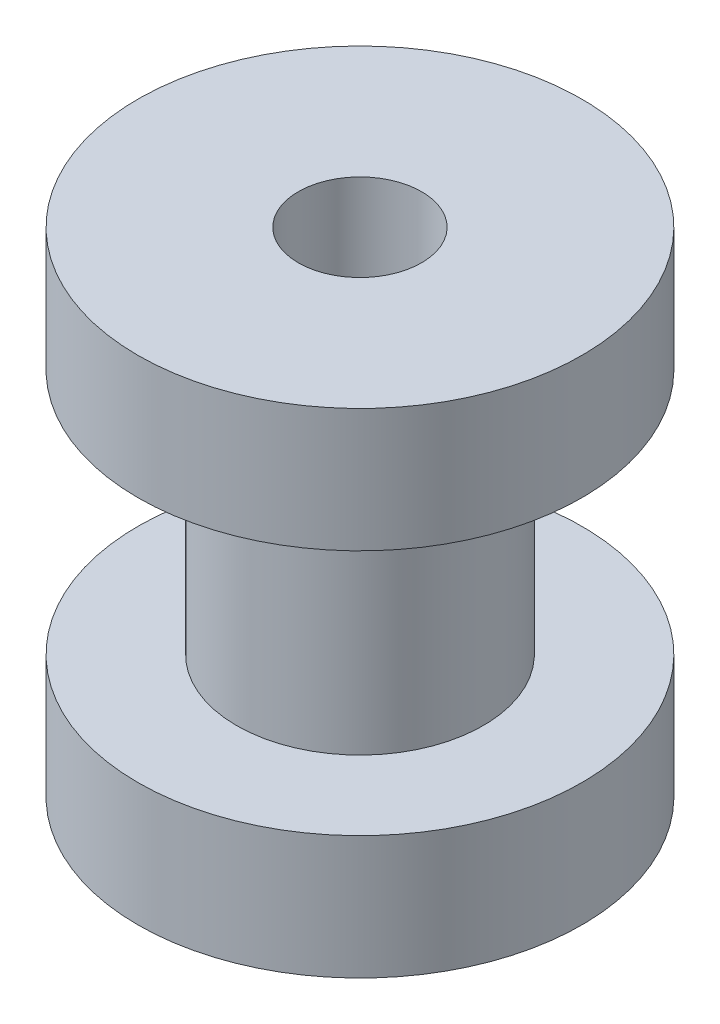
ISO-10303-21;
HEADER;
FILE_DESCRIPTION(('STEP AP214'),'2;1');
FILE_NAME('part.step','',(''),(''),'','','');
FILE_SCHEMA(('AUTOMOTIVE_DESIGN { 1 0 10303 214 1 1 1 1 }'));
ENDSEC;
DATA;
#1=APPLICATION_CONTEXT('core data for automotive mechanical design processes');
#2=APPLICATION_PROTOCOL_DEFINITION('international standard','automotive_design',2000,#1);
#3=PRODUCT_CONTEXT('',#1,'mechanical');
#4=PRODUCT('Part','Part','',(#3));
#5=PRODUCT_RELATED_PRODUCT_CATEGORY('part','',(#4));
#6=PRODUCT_DEFINITION_FORMATION('','',#4);
#7=PRODUCT_DEFINITION_CONTEXT('part definition',#1,'design');
#8=PRODUCT_DEFINITION('design','',#6,#7);
#9=PRODUCT_DEFINITION_SHAPE('','',#8);
#10=(LENGTH_UNIT() NAMED_UNIT(*) SI_UNIT(.MILLI.,.METRE.));
#11=(NAMED_UNIT(*) PLANE_ANGLE_UNIT() SI_UNIT($,.RADIAN.));
#12=(NAMED_UNIT(*) SI_UNIT($,.STERADIAN.) SOLID_ANGLE_UNIT());
#13=UNCERTAINTY_MEASURE_WITH_UNIT(LENGTH_MEASURE(1.E-05),#10,'distance_accuracy_value','');
#14=(GEOMETRIC_REPRESENTATION_CONTEXT(3) GLOBAL_UNCERTAINTY_ASSIGNED_CONTEXT((#13)) GLOBAL_UNIT_ASSIGNED_CONTEXT((#10,
#11,#12)) REPRESENTATION_CONTEXT('',''));
#15=CARTESIAN_POINT('',(0.,0.,0.));
#16=DIRECTION('',(0.,0.,1.));
#17=DIRECTION('',(1.,0.,0.));
#18=AXIS2_PLACEMENT_3D('',#15,#16,#17);
#19=CARTESIAN_POINT('',(0.,5.,0.));
#20=DIRECTION('',(0.,-1.,0.));
#21=DIRECTION('',(0.,0.,-1.));
#22=AXIS2_PLACEMENT_3D('',#19,#20,#21);
#23=CYLINDRICAL_SURFACE('',#22,5.);
#24=CARTESIAN_POINT('',(0.,5.,0.));
#25=DIRECTION('',(0.,1.,0.));
#26=DIRECTION('',(0.,0.,1.));
#27=AXIS2_PLACEMENT_3D('',#24,#25,#26);
#28=CIRCLE('',#27,5.);
#29=CARTESIAN_POINT('',(0.,5.,5.));
#30=VERTEX_POINT('',#29);
#31=EDGE_CURVE('E10',#30,#30,#28,.T.);
#32=ORIENTED_EDGE('',*,*,#31,.F.);
#33=EDGE_LOOP('',(#32));
#34=FACE_BOUND('',#33,.T.);
#35=CARTESIAN_POINT('',(0.,-5.,0.));
#36=DIRECTION('',(0.,1.,0.));
#37=DIRECTION('',(0.,0.,1.));
#38=AXIS2_PLACEMENT_3D('',#35,#36,#37);
#39=CIRCLE('',#38,5.);
#40=CARTESIAN_POINT('',(0.,-5.,5.));
#41=VERTEX_POINT('',#40);
#42=EDGE_CURVE('E54',#41,#41,#39,.T.);
#43=ORIENTED_EDGE('',*,*,#42,.T.);
#44=EDGE_LOOP('',(#43));
#45=FACE_BOUND('',#44,.T.);
#46=ADVANCED_FACE('F39',(#34,#45),#23,.T.);
#47=CARTESIAN_POINT('',(0.,10.,0.));
#48=DIRECTION('',(0.,-1.,0.));
#49=DIRECTION('',(0.,0.,-1.));
#50=AXIS2_PLACEMENT_3D('',#47,#48,#49);
#51=CYLINDRICAL_SURFACE('',#50,9.);
#52=CARTESIAN_POINT('',(0.,10.,0.));
#53=DIRECTION('',(0.,1.,0.));
#54=DIRECTION('',(0.,0.,1.));
#55=AXIS2_PLACEMENT_3D('',#52,#53,#54);
#56=CIRCLE('',#55,9.);
#57=CARTESIAN_POINT('',(0.,10.,9.));
#58=VERTEX_POINT('',#57);
#59=EDGE_CURVE('E45',#58,#58,#56,.T.);
#60=ORIENTED_EDGE('',*,*,#59,.F.);
#61=EDGE_LOOP('',(#60));
#62=FACE_BOUND('',#61,.T.);
#63=CARTESIAN_POINT('',(0.,5.,0.));
#64=DIRECTION('',(0.,1.,0.));
#65=DIRECTION('',(0.,0.,1.));
#66=AXIS2_PLACEMENT_3D('',#63,#64,#65);
#67=CIRCLE('',#66,9.);
#68=CARTESIAN_POINT('',(0.,5.,9.));
#69=VERTEX_POINT('',#68);
#70=EDGE_CURVE('E49',#69,#69,#67,.T.);
#71=ORIENTED_EDGE('',*,*,#70,.T.);
#72=EDGE_LOOP('',(#71));
#73=FACE_BOUND('',#72,.T.);
#74=ADVANCED_FACE('F76',(#62,#73),#51,.T.);
#75=CARTESIAN_POINT('',(0.,10.,0.));
#76=DIRECTION('',(0.,1.,0.));
#77=DIRECTION('',(0.,0.,1.));
#78=AXIS2_PLACEMENT_3D('',#75,#76,#77);
#79=PLANE('',#78);
#80=CARTESIAN_POINT('',(0.,10.,0.));
#81=DIRECTION('',(0.,1.,0.));
#82=DIRECTION('',(0.,0.,1.));
#83=AXIS2_PLACEMENT_3D('',#80,#81,#82);
#84=CIRCLE('',#83,2.5);
#85=CARTESIAN_POINT('',(0.,10.,2.5));
#86=VERTEX_POINT('',#85);
#87=EDGE_CURVE('E67',#86,#86,#84,.T.);
#88=ORIENTED_EDGE('',*,*,#87,.F.);
#89=EDGE_LOOP('',(#88));
#90=FACE_BOUND('',#89,.T.);
#91=ORIENTED_EDGE('',*,*,#59,.T.);
#92=EDGE_LOOP('',(#91));
#93=FACE_BOUND('',#92,.T.);
#94=ADVANCED_FACE('F73',(#90,#93),#79,.T.);
#95=CARTESIAN_POINT('',(0.,5.,0.));
#96=DIRECTION('',(0.,1.,0.));
#97=DIRECTION('',(0.,0.,1.));
#98=AXIS2_PLACEMENT_3D('',#95,#96,#97);
#99=PLANE('',#98);
#100=ORIENTED_EDGE('',*,*,#31,.T.);
#101=EDGE_LOOP('',(#100));
#102=FACE_BOUND('',#101,.T.);
#103=ORIENTED_EDGE('',*,*,#70,.F.);
#104=EDGE_LOOP('',(#103));
#105=FACE_BOUND('',#104,.T.);
#106=ADVANCED_FACE('F75',(#102,#105),#99,.F.);
#107=CARTESIAN_POINT('',(0.,-10.,0.));
#108=DIRECTION('',(0.,1.,0.));
#109=DIRECTION('',(0.,0.,1.));
#110=AXIS2_PLACEMENT_3D('',#107,#108,#109);
#111=CYLINDRICAL_SURFACE('',#110,9.);
#112=CARTESIAN_POINT('',(0.,-10.,0.));
#113=DIRECTION('',(0.,1.,0.));
#114=DIRECTION('',(0.,0.,1.));
#115=AXIS2_PLACEMENT_3D('',#112,#113,#114);
#116=CIRCLE('',#115,9.);
#117=CARTESIAN_POINT('',(0.,-10.,9.));
#118=VERTEX_POINT('',#117);
#119=EDGE_CURVE('E58',#118,#118,#116,.T.);
#120=ORIENTED_EDGE('',*,*,#119,.T.);
#121=EDGE_LOOP('',(#120));
#122=FACE_BOUND('',#121,.T.);
#123=CARTESIAN_POINT('',(0.,-5.,0.));
#124=DIRECTION('',(0.,1.,0.));
#125=DIRECTION('',(0.,0.,1.));
#126=AXIS2_PLACEMENT_3D('',#123,#124,#125);
#127=CIRCLE('',#126,9.);
#128=CARTESIAN_POINT('',(0.,-5.,9.));
#129=VERTEX_POINT('',#128);
#130=EDGE_CURVE('E59',#129,#129,#127,.T.);
#131=ORIENTED_EDGE('',*,*,#130,.F.);
#132=EDGE_LOOP('',(#131));
#133=FACE_BOUND('',#132,.T.);
#134=ADVANCED_FACE('F83',(#122,#133),#111,.T.);
#135=CARTESIAN_POINT('',(0.,-10.,0.));
#136=DIRECTION('',(0.,-1.,0.));
#137=DIRECTION('',(0.,0.,1.));
#138=AXIS2_PLACEMENT_3D('',#135,#136,#137);
#139=PLANE('',#138);
#140=CARTESIAN_POINT('',(0.,-10.,0.));
#141=DIRECTION('',(0.,1.,0.));
#142=DIRECTION('',(0.,0.,1.));
#143=AXIS2_PLACEMENT_3D('',#140,#141,#142);
#144=CIRCLE('',#143,2.5);
#145=CARTESIAN_POINT('',(0.,-10.,2.5));
#146=VERTEX_POINT('',#145);
#147=EDGE_CURVE('E62',#146,#146,#144,.T.);
#148=ORIENTED_EDGE('',*,*,#147,.T.);
#149=EDGE_LOOP('',(#148));
#150=FACE_BOUND('',#149,.T.);
#151=ORIENTED_EDGE('',*,*,#119,.F.);
#152=EDGE_LOOP('',(#151));
#153=FACE_BOUND('',#152,.T.);
#154=ADVANCED_FACE('F98',(#150,#153),#139,.T.);
#155=CARTESIAN_POINT('',(0.,-5.,0.));
#156=DIRECTION('',(0.,-1.,0.));
#157=DIRECTION('',(0.,0.,1.));
#158=AXIS2_PLACEMENT_3D('',#155,#156,#157);
#159=PLANE('',#158);
#160=ORIENTED_EDGE('',*,*,#42,.F.);
#161=EDGE_LOOP('',(#160));
#162=FACE_BOUND('',#161,.T.);
#163=ORIENTED_EDGE('',*,*,#130,.T.);
#164=EDGE_LOOP('',(#163));
#165=FACE_BOUND('',#164,.T.);
#166=ADVANCED_FACE('F96',(#162,#165),#159,.F.);
#167=CARTESIAN_POINT('',(0.,-10.,0.));
#168=DIRECTION('',(0.,1.,0.));
#169=DIRECTION('',(0.,0.,1.));
#170=AXIS2_PLACEMENT_3D('',#167,#168,#169);
#171=CYLINDRICAL_SURFACE('',#170,2.5);
#172=ORIENTED_EDGE('',*,*,#147,.F.);
#173=EDGE_LOOP('',(#172));
#174=FACE_BOUND('',#173,.T.);
#175=ORIENTED_EDGE('',*,*,#87,.T.);
#176=EDGE_LOOP('',(#175));
#177=FACE_BOUND('',#176,.T.);
#178=ADVANCED_FACE('F71',(#174,#177),#171,.F.);
#179=CLOSED_SHELL('',(#46,#74,#94,#106,#134,#154,#166,#178));
#180=MANIFOLD_SOLID_BREP('B2',#179);
#181=ADVANCED_BREP_SHAPE_REPRESENTATION('',(#18,#180),#14);
#182=SHAPE_DEFINITION_REPRESENTATION(#9,#181);
ENDSEC;
END-ISO-10303-21;
